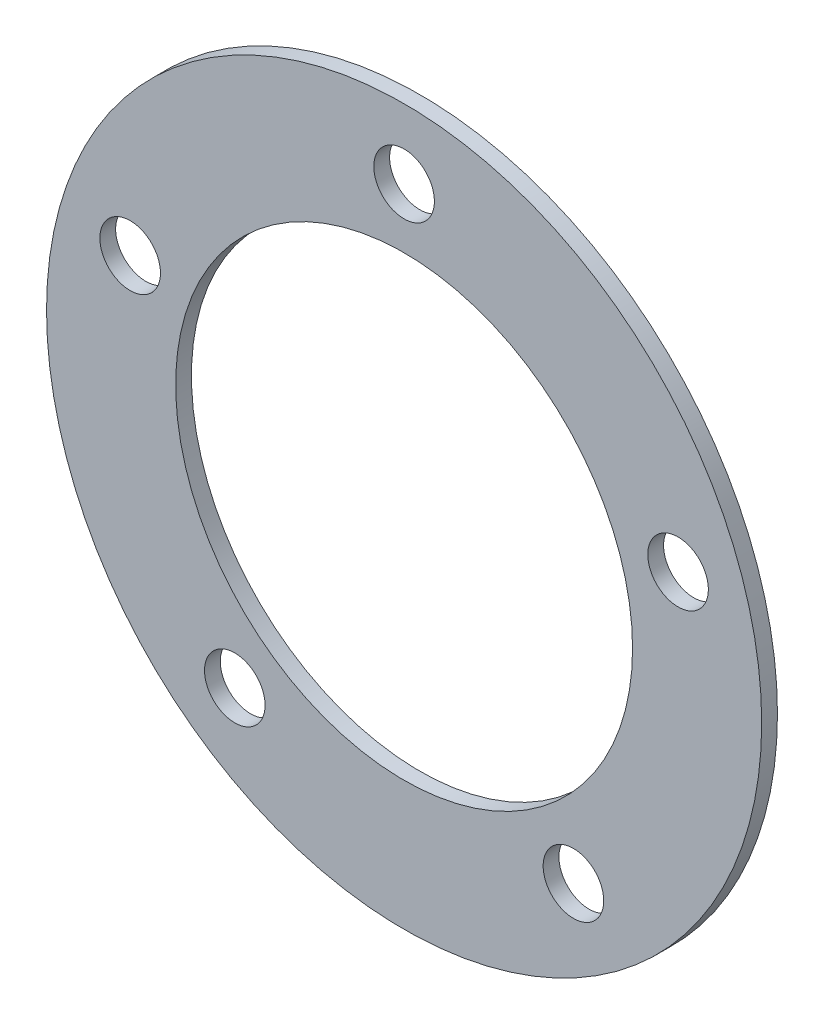
ISO-10303-21;
HEADER;
FILE_DESCRIPTION(('STEP AP214'),'2;1');
FILE_NAME('part.step','',(''),(''),'','','');
FILE_SCHEMA(('AUTOMOTIVE_DESIGN { 1 0 10303 214 1 1 1 1 }'));
ENDSEC;
DATA;
#1=APPLICATION_CONTEXT('core data for automotive mechanical design processes');
#2=APPLICATION_PROTOCOL_DEFINITION('international standard','automotive_design',2000,#1);
#3=PRODUCT_CONTEXT('',#1,'mechanical');
#4=PRODUCT('Part','Part','',(#3));
#5=PRODUCT_RELATED_PRODUCT_CATEGORY('part','',(#4));
#6=PRODUCT_DEFINITION_FORMATION('','',#4);
#7=PRODUCT_DEFINITION_CONTEXT('part definition',#1,'design');
#8=PRODUCT_DEFINITION('design','',#6,#7);
#9=PRODUCT_DEFINITION_SHAPE('','',#8);
#10=(LENGTH_UNIT() NAMED_UNIT(*) SI_UNIT(.MILLI.,.METRE.));
#11=(NAMED_UNIT(*) PLANE_ANGLE_UNIT() SI_UNIT($,.RADIAN.));
#12=(NAMED_UNIT(*) SI_UNIT($,.STERADIAN.) SOLID_ANGLE_UNIT());
#13=UNCERTAINTY_MEASURE_WITH_UNIT(LENGTH_MEASURE(1.E-05),#10,'distance_accuracy_value','');
#14=(GEOMETRIC_REPRESENTATION_CONTEXT(3) GLOBAL_UNCERTAINTY_ASSIGNED_CONTEXT((#13)) GLOBAL_UNIT_ASSIGNED_CONTEXT((#10,
#11,#12)) REPRESENTATION_CONTEXT('',''));
#15=CARTESIAN_POINT('',(0.,0.,0.));
#16=DIRECTION('',(0.,0.,1.));
#17=DIRECTION('',(1.,0.,0.));
#18=AXIS2_PLACEMENT_3D('',#15,#16,#17);
#19=CARTESIAN_POINT('',(0.,0.,0.79375));
#20=DIRECTION('',(0.,0.,1.));
#21=DIRECTION('',(1.,0.,0.));
#22=AXIS2_PLACEMENT_3D('',#19,#20,#21);
#23=PLANE('',#22);
#24=CARTESIAN_POINT('',(-8.5228861582407,-11.7307464184369,0.79375));
#25=DIRECTION('',(0.,0.,1.));
#26=DIRECTION('',(1.,0.,0.));
#27=AXIS2_PLACEMENT_3D('',#24,#25,#26);
#28=CIRCLE('',#27,1.525);
#29=CARTESIAN_POINT('',(-6.9978861582407,-11.7307464184369,0.79375));
#30=VERTEX_POINT('',#29);
#31=EDGE_CURVE('E64',#30,#30,#28,.T.);
#32=ORIENTED_EDGE('',*,*,#31,.F.);
#33=EDGE_LOOP('',(#32));
#34=FACE_BOUND('',#33,.T.);
#35=CARTESIAN_POINT('',(13.7903194862797,4.4807464184368,0.79375));
#36=DIRECTION('',(0.,0.,1.));
#37=DIRECTION('',(1.,0.,0.));
#38=AXIS2_PLACEMENT_3D('',#35,#36,#37);
#39=CIRCLE('',#38,1.525);
#40=CARTESIAN_POINT('',(15.3153194862797,4.4807464184368,0.79375));
#41=VERTEX_POINT('',#40);
#42=EDGE_CURVE('E52',#41,#41,#39,.T.);
#43=ORIENTED_EDGE('',*,*,#42,.F.);
#44=EDGE_LOOP('',(#43));
#45=FACE_BOUND('',#44,.T.);
#46=CARTESIAN_POINT('',(0.,0.,0.79375));
#47=DIRECTION('',(0.,0.,1.));
#48=DIRECTION('',(1.,0.,0.));
#49=AXIS2_PLACEMENT_3D('',#46,#47,#48);
#50=CIRCLE('',#49,11.5);
#51=CARTESIAN_POINT('',(11.5,0.,0.79375));
#52=VERTEX_POINT('',#51);
#53=EDGE_CURVE('E41',#52,#52,#50,.T.);
#54=ORIENTED_EDGE('',*,*,#53,.F.);
#55=EDGE_LOOP('',(#54));
#56=FACE_BOUND('',#55,.T.);
#57=CARTESIAN_POINT('',(0.,0.,0.79375));
#58=DIRECTION('',(0.,0.,1.));
#59=DIRECTION('',(1.,0.,0.));
#60=AXIS2_PLACEMENT_3D('',#57,#58,#59);
#61=CIRCLE('',#60,18.);
#62=CARTESIAN_POINT('',(18.,0.,0.79375));
#63=VERTEX_POINT('',#62);
#64=EDGE_CURVE('E10',#63,#63,#61,.T.);
#65=ORIENTED_EDGE('',*,*,#64,.T.);
#66=EDGE_LOOP('',(#65));
#67=FACE_BOUND('',#66,.T.);
#68=CARTESIAN_POINT('',(0.,14.5,0.79375));
#69=DIRECTION('',(0.,0.,1.));
#70=DIRECTION('',(1.,0.,0.));
#71=AXIS2_PLACEMENT_3D('',#68,#69,#70);
#72=CIRCLE('',#71,1.525);
#73=CARTESIAN_POINT('',(1.525,14.5,0.79375));
#74=VERTEX_POINT('',#73);
#75=EDGE_CURVE('E46',#74,#74,#72,.T.);
#76=ORIENTED_EDGE('',*,*,#75,.F.);
#77=EDGE_LOOP('',(#76));
#78=FACE_BOUND('',#77,.T.);
#79=CARTESIAN_POINT('',(8.52288615824097,-11.7307464184367,0.79375));
#80=DIRECTION('',(0.,0.,1.));
#81=DIRECTION('',(1.,0.,0.));
#82=AXIS2_PLACEMENT_3D('',#79,#80,#81);
#83=CIRCLE('',#82,1.525);
#84=CARTESIAN_POINT('',(10.047886158241,-11.7307464184367,0.79375));
#85=VERTEX_POINT('',#84);
#86=EDGE_CURVE('E58',#85,#85,#83,.T.);
#87=ORIENTED_EDGE('',*,*,#86,.F.);
#88=EDGE_LOOP('',(#87));
#89=FACE_BOUND('',#88,.T.);
#90=CARTESIAN_POINT('',(-13.7903194862798,4.48074641843648,0.79375));
#91=DIRECTION('',(0.,0.,1.));
#92=DIRECTION('',(1.,0.,0.));
#93=AXIS2_PLACEMENT_3D('',#90,#91,#92);
#94=CIRCLE('',#93,1.525);
#95=CARTESIAN_POINT('',(-12.2653194862798,4.48074641843648,0.79375));
#96=VERTEX_POINT('',#95);
#97=EDGE_CURVE('E70',#96,#96,#94,.T.);
#98=ORIENTED_EDGE('',*,*,#97,.F.);
#99=EDGE_LOOP('',(#98));
#100=FACE_BOUND('',#99,.T.);
#101=ADVANCED_FACE('F30',(#34,#45,#56,#67,#78,#89,#100),#23,.T.);
#102=CARTESIAN_POINT('',(0.,0.,0.));
#103=DIRECTION('',(0.,0.,1.));
#104=DIRECTION('',(1.,0.,0.));
#105=AXIS2_PLACEMENT_3D('',#102,#103,#104);
#106=PLANE('',#105);
#107=CARTESIAN_POINT('',(0.,0.,0.));
#108=DIRECTION('',(0.,0.,1.));
#109=DIRECTION('',(1.,0.,0.));
#110=AXIS2_PLACEMENT_3D('',#107,#108,#109);
#111=CIRCLE('',#110,18.);
#112=CARTESIAN_POINT('',(18.,0.,0.));
#113=VERTEX_POINT('',#112);
#114=EDGE_CURVE('E34',#113,#113,#111,.T.);
#115=ORIENTED_EDGE('',*,*,#114,.F.);
#116=EDGE_LOOP('',(#115));
#117=FACE_BOUND('',#116,.T.);
#118=CARTESIAN_POINT('',(0.,0.,0.));
#119=DIRECTION('',(0.,0.,1.));
#120=DIRECTION('',(1.,0.,0.));
#121=AXIS2_PLACEMENT_3D('',#118,#119,#120);
#122=CIRCLE('',#121,11.5);
#123=CARTESIAN_POINT('',(11.5,0.,0.));
#124=VERTEX_POINT('',#123);
#125=EDGE_CURVE('E43',#124,#124,#122,.T.);
#126=ORIENTED_EDGE('',*,*,#125,.T.);
#127=EDGE_LOOP('',(#126));
#128=FACE_BOUND('',#127,.T.);
#129=CARTESIAN_POINT('',(0.,14.5,0.));
#130=DIRECTION('',(0.,0.,1.));
#131=DIRECTION('',(1.,0.,0.));
#132=AXIS2_PLACEMENT_3D('',#129,#130,#131);
#133=CIRCLE('',#132,1.525);
#134=CARTESIAN_POINT('',(1.525,14.5,0.));
#135=VERTEX_POINT('',#134);
#136=EDGE_CURVE('E49',#135,#135,#133,.T.);
#137=ORIENTED_EDGE('',*,*,#136,.T.);
#138=EDGE_LOOP('',(#137));
#139=FACE_BOUND('',#138,.T.);
#140=CARTESIAN_POINT('',(13.7903194862797,4.4807464184368,0.));
#141=DIRECTION('',(0.,0.,1.));
#142=DIRECTION('',(1.,0.,0.));
#143=AXIS2_PLACEMENT_3D('',#140,#141,#142);
#144=CIRCLE('',#143,1.525);
#145=CARTESIAN_POINT('',(15.3153194862797,4.4807464184368,0.));
#146=VERTEX_POINT('',#145);
#147=EDGE_CURVE('E55',#146,#146,#144,.T.);
#148=ORIENTED_EDGE('',*,*,#147,.T.);
#149=EDGE_LOOP('',(#148));
#150=FACE_BOUND('',#149,.T.);
#151=CARTESIAN_POINT('',(8.52288615824097,-11.7307464184367,0.));
#152=DIRECTION('',(0.,0.,1.));
#153=DIRECTION('',(1.,0.,0.));
#154=AXIS2_PLACEMENT_3D('',#151,#152,#153);
#155=CIRCLE('',#154,1.525);
#156=CARTESIAN_POINT('',(10.047886158241,-11.7307464184367,0.));
#157=VERTEX_POINT('',#156);
#158=EDGE_CURVE('E61',#157,#157,#155,.T.);
#159=ORIENTED_EDGE('',*,*,#158,.T.);
#160=EDGE_LOOP('',(#159));
#161=FACE_BOUND('',#160,.T.);
#162=CARTESIAN_POINT('',(-8.5228861582407,-11.7307464184369,0.));
#163=DIRECTION('',(0.,0.,1.));
#164=DIRECTION('',(1.,0.,0.));
#165=AXIS2_PLACEMENT_3D('',#162,#163,#164);
#166=CIRCLE('',#165,1.525);
#167=CARTESIAN_POINT('',(-6.9978861582407,-11.7307464184369,0.));
#168=VERTEX_POINT('',#167);
#169=EDGE_CURVE('E67',#168,#168,#166,.T.);
#170=ORIENTED_EDGE('',*,*,#169,.T.);
#171=EDGE_LOOP('',(#170));
#172=FACE_BOUND('',#171,.T.);
#173=CARTESIAN_POINT('',(-13.7903194862798,4.48074641843648,0.));
#174=DIRECTION('',(0.,0.,1.));
#175=DIRECTION('',(1.,0.,0.));
#176=AXIS2_PLACEMENT_3D('',#173,#174,#175);
#177=CIRCLE('',#176,1.525);
#178=CARTESIAN_POINT('',(-12.2653194862798,4.48074641843648,0.));
#179=VERTEX_POINT('',#178);
#180=EDGE_CURVE('E73',#179,#179,#177,.T.);
#181=ORIENTED_EDGE('',*,*,#180,.T.);
#182=EDGE_LOOP('',(#181));
#183=FACE_BOUND('',#182,.T.);
#184=ADVANCED_FACE('F83',(#117,#128,#139,#150,#161,#172,#183),#106,.F.);
#185=CARTESIAN_POINT('',(0.,0.,0.79375));
#186=DIRECTION('',(0.,0.,-1.));
#187=DIRECTION('',(-1.,0.,0.));
#188=AXIS2_PLACEMENT_3D('',#185,#186,#187);
#189=CYLINDRICAL_SURFACE('',#188,18.);
#190=ORIENTED_EDGE('',*,*,#64,.F.);
#191=EDGE_LOOP('',(#190));
#192=FACE_BOUND('',#191,.T.);
#193=ORIENTED_EDGE('',*,*,#114,.T.);
#194=EDGE_LOOP('',(#193));
#195=FACE_BOUND('',#194,.T.);
#196=ADVANCED_FACE('F32',(#192,#195),#189,.T.);
#197=CARTESIAN_POINT('',(0.,0.,0.79375));
#198=DIRECTION('',(0.,0.,-1.));
#199=DIRECTION('',(-1.,0.,0.));
#200=AXIS2_PLACEMENT_3D('',#197,#198,#199);
#201=CYLINDRICAL_SURFACE('',#200,11.5);
#202=ORIENTED_EDGE('',*,*,#53,.T.);
#203=EDGE_LOOP('',(#202));
#204=FACE_BOUND('',#203,.T.);
#205=ORIENTED_EDGE('',*,*,#125,.F.);
#206=EDGE_LOOP('',(#205));
#207=FACE_BOUND('',#206,.T.);
#208=ADVANCED_FACE('F93',(#204,#207),#201,.F.);
#209=CARTESIAN_POINT('',(0.,14.5,0.79375));
#210=DIRECTION('',(0.,0.,-1.));
#211=DIRECTION('',(-1.,0.,0.));
#212=AXIS2_PLACEMENT_3D('',#209,#210,#211);
#213=CYLINDRICAL_SURFACE('',#212,1.525);
#214=ORIENTED_EDGE('',*,*,#75,.T.);
#215=EDGE_LOOP('',(#214));
#216=FACE_BOUND('',#215,.T.);
#217=ORIENTED_EDGE('',*,*,#136,.F.);
#218=EDGE_LOOP('',(#217));
#219=FACE_BOUND('',#218,.T.);
#220=ADVANCED_FACE('F96',(#216,#219),#213,.F.);
#221=CARTESIAN_POINT('',(13.7903194862797,4.4807464184368,0.79375));
#222=DIRECTION('',(0.,0.,-1.));
#223=DIRECTION('',(-1.,0.,0.));
#224=AXIS2_PLACEMENT_3D('',#221,#222,#223);
#225=CYLINDRICAL_SURFACE('',#224,1.525);
#226=ORIENTED_EDGE('',*,*,#42,.T.);
#227=EDGE_LOOP('',(#226));
#228=FACE_BOUND('',#227,.T.);
#229=ORIENTED_EDGE('',*,*,#147,.F.);
#230=EDGE_LOOP('',(#229));
#231=FACE_BOUND('',#230,.T.);
#232=ADVANCED_FACE('F100',(#228,#231),#225,.F.);
#233=CARTESIAN_POINT('',(8.52288615824097,-11.7307464184367,0.79375));
#234=DIRECTION('',(0.,0.,-1.));
#235=DIRECTION('',(-1.,0.,0.));
#236=AXIS2_PLACEMENT_3D('',#233,#234,#235);
#237=CYLINDRICAL_SURFACE('',#236,1.525);
#238=ORIENTED_EDGE('',*,*,#86,.T.);
#239=EDGE_LOOP('',(#238));
#240=FACE_BOUND('',#239,.T.);
#241=ORIENTED_EDGE('',*,*,#158,.F.);
#242=EDGE_LOOP('',(#241));
#243=FACE_BOUND('',#242,.T.);
#244=ADVANCED_FACE('F104',(#240,#243),#237,.F.);
#245=CARTESIAN_POINT('',(-8.5228861582407,-11.7307464184369,0.79375));
#246=DIRECTION('',(0.,0.,-1.));
#247=DIRECTION('',(-1.,0.,0.));
#248=AXIS2_PLACEMENT_3D('',#245,#246,#247);
#249=CYLINDRICAL_SURFACE('',#248,1.525);
#250=ORIENTED_EDGE('',*,*,#31,.T.);
#251=EDGE_LOOP('',(#250));
#252=FACE_BOUND('',#251,.T.);
#253=ORIENTED_EDGE('',*,*,#169,.F.);
#254=EDGE_LOOP('',(#253));
#255=FACE_BOUND('',#254,.T.);
#256=ADVANCED_FACE('F108',(#252,#255),#249,.F.);
#257=CARTESIAN_POINT('',(-13.7903194862798,4.48074641843648,0.79375));
#258=DIRECTION('',(0.,0.,-1.));
#259=DIRECTION('',(-1.,0.,0.));
#260=AXIS2_PLACEMENT_3D('',#257,#258,#259);
#261=CYLINDRICAL_SURFACE('',#260,1.525);
#262=ORIENTED_EDGE('',*,*,#97,.T.);
#263=EDGE_LOOP('',(#262));
#264=FACE_BOUND('',#263,.T.);
#265=ORIENTED_EDGE('',*,*,#180,.F.);
#266=EDGE_LOOP('',(#265));
#267=FACE_BOUND('',#266,.T.);
#268=ADVANCED_FACE('F79',(#264,#267),#261,.F.);
#269=CLOSED_SHELL('',(#101,#184,#196,#208,#220,#232,#244,#256,#268));
#270=MANIFOLD_SOLID_BREP('B2',#269);
#271=ADVANCED_BREP_SHAPE_REPRESENTATION('',(#18,#270),#14);
#272=SHAPE_DEFINITION_REPRESENTATION(#9,#271);
ENDSEC;
END-ISO-10303-21;
